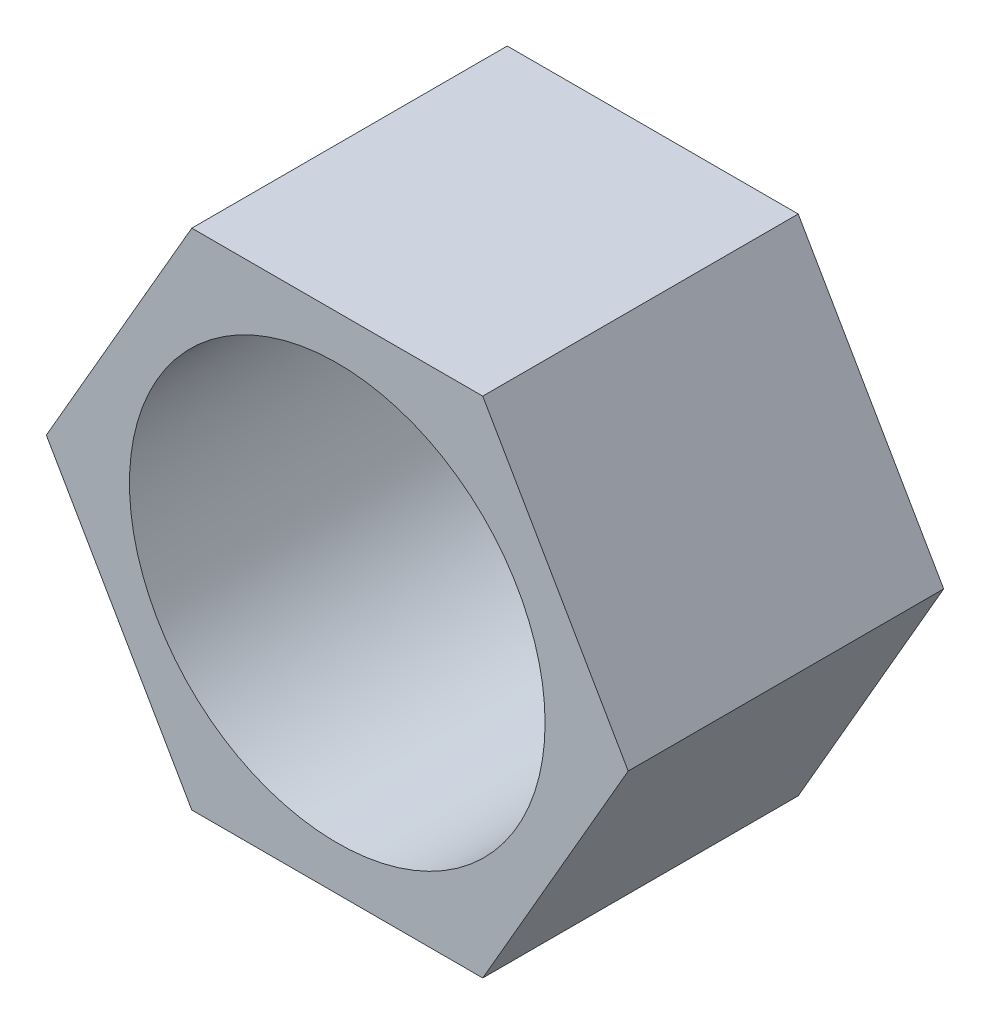
ISO-10303-21;
HEADER;
FILE_DESCRIPTION(('STEP AP214'),'2;1');
FILE_NAME('part.step','',(''),(''),'','','');
FILE_SCHEMA(('AUTOMOTIVE_DESIGN { 1 0 10303 214 1 1 1 1 }'));
ENDSEC;
DATA;
#1=APPLICATION_CONTEXT('core data for automotive mechanical design processes');
#2=APPLICATION_PROTOCOL_DEFINITION('international standard','automotive_design',2000,#1);
#3=PRODUCT_CONTEXT('',#1,'mechanical');
#4=PRODUCT('Part','Part','',(#3));
#5=PRODUCT_RELATED_PRODUCT_CATEGORY('part','',(#4));
#6=PRODUCT_DEFINITION_FORMATION('','',#4);
#7=PRODUCT_DEFINITION_CONTEXT('part definition',#1,'design');
#8=PRODUCT_DEFINITION('design','',#6,#7);
#9=PRODUCT_DEFINITION_SHAPE('','',#8);
#10=(LENGTH_UNIT() NAMED_UNIT(*) SI_UNIT(.MILLI.,.METRE.));
#11=(NAMED_UNIT(*) PLANE_ANGLE_UNIT() SI_UNIT($,.RADIAN.));
#12=(NAMED_UNIT(*) SI_UNIT($,.STERADIAN.) SOLID_ANGLE_UNIT());
#13=UNCERTAINTY_MEASURE_WITH_UNIT(LENGTH_MEASURE(1.E-05),#10,'distance_accuracy_value','');
#14=(GEOMETRIC_REPRESENTATION_CONTEXT(3) GLOBAL_UNCERTAINTY_ASSIGNED_CONTEXT((#13)) GLOBAL_UNIT_ASSIGNED_CONTEXT((#10,
#11,#12)) REPRESENTATION_CONTEXT('',''));
#15=CARTESIAN_POINT('',(0.,0.,0.));
#16=DIRECTION('',(0.,0.,1.));
#17=DIRECTION('',(1.,0.,0.));
#18=AXIS2_PLACEMENT_3D('',#15,#16,#17);
#19=CARTESIAN_POINT('',(0.,0.,7.59));
#20=DIRECTION('',(0.,0.,1.));
#21=DIRECTION('',(1.,0.,0.));
#22=AXIS2_PLACEMENT_3D('',#19,#20,#21);
#23=PLANE('',#22);
#24=DIRECTION('',(0.499999999999995,0.866025403784442,0.));
#25=VECTOR('',#24,1.);
#26=CARTESIAN_POINT('',(3.50000000000007,-6.06217782649103,7.59));
#27=LINE('',#26,#25);
#28=CARTESIAN_POINT('',(3.50000000000007,-6.06217782649103,7.59));
#29=VERTEX_POINT('',#28);
#30=CARTESIAN_POINT('',(7.,0.,7.59));
#31=VERTEX_POINT('',#30);
#32=EDGE_CURVE('E146',#29,#31,#27,.T.);
#33=ORIENTED_EDGE('',*,*,#32,.T.);
#34=DIRECTION('',(-0.500000000000001,0.866025403784438,0.));
#35=VECTOR('',#34,1.);
#36=CARTESIAN_POINT('',(7.,0.,7.59));
#37=LINE('',#36,#35);
#38=CARTESIAN_POINT('',(3.49999999999999,6.06217782649108,7.59));
#39=VERTEX_POINT('',#38);
#40=EDGE_CURVE('E94',#31,#39,#37,.T.);
#41=ORIENTED_EDGE('',*,*,#40,.T.);
#42=DIRECTION('',(-1.,0.,0.));
#43=VECTOR('',#42,1.);
#44=CARTESIAN_POINT('',(3.49999999999999,6.06217782649108,7.59));
#45=LINE('',#44,#43);
#46=CARTESIAN_POINT('',(-3.50000000000003,6.06217782649105,7.59));
#47=VERTEX_POINT('',#46);
#48=EDGE_CURVE('E107',#39,#47,#45,.T.);
#49=ORIENTED_EDGE('',*,*,#48,.T.);
#50=DIRECTION('',(-0.499999999999995,-0.866025403784441,0.));
#51=VECTOR('',#50,1.);
#52=CARTESIAN_POINT('',(-3.50000000000003,6.06217782649105,7.59));
#53=LINE('',#52,#51);
#54=CARTESIAN_POINT('',(-7.,0.,7.59));
#55=VERTEX_POINT('',#54);
#56=EDGE_CURVE('E101',#47,#55,#53,.T.);
#57=ORIENTED_EDGE('',*,*,#56,.T.);
#58=DIRECTION('',(0.500000000000007,-0.866025403784435,0.));
#59=VECTOR('',#58,1.);
#60=CARTESIAN_POINT('',(-7.,0.,7.59));
#61=LINE('',#60,#59);
#62=CARTESIAN_POINT('',(-3.49999999999994,-6.0621778264911,7.59));
#63=VERTEX_POINT('',#62);
#64=EDGE_CURVE('E105',#55,#63,#61,.T.);
#65=ORIENTED_EDGE('',*,*,#64,.T.);
#66=DIRECTION('',(1.,0.,0.));
#67=VECTOR('',#66,1.);
#68=CARTESIAN_POINT('',(-3.49999999999994,-6.0621778264911,7.59));
#69=LINE('',#68,#67);
#70=EDGE_CURVE('E57',#63,#29,#69,.T.);
#71=ORIENTED_EDGE('',*,*,#70,.T.);
#72=EDGE_LOOP('',(#33,#41,#49,#57,#65,#71));
#73=FACE_BOUND('',#72,.T.);
#74=CARTESIAN_POINT('',(0.,0.,7.59));
#75=DIRECTION('',(0.,0.,1.));
#76=DIRECTION('',(1.,0.,0.));
#77=AXIS2_PLACEMENT_3D('',#74,#75,#76);
#78=CIRCLE('',#77,5.);
#79=CARTESIAN_POINT('',(5.,0.,7.59));
#80=VERTEX_POINT('',#79);
#81=EDGE_CURVE('E134',#80,#80,#78,.T.);
#82=ORIENTED_EDGE('',*,*,#81,.F.);
#83=EDGE_LOOP('',(#82));
#84=FACE_BOUND('',#83,.T.);
#85=ADVANCED_FACE('F39',(#73,#84),#23,.T.);
#86=CARTESIAN_POINT('',(0.,0.,0.));
#87=DIRECTION('',(0.,0.,1.));
#88=DIRECTION('',(1.,0.,0.));
#89=AXIS2_PLACEMENT_3D('',#86,#87,#88);
#90=PLANE('',#89);
#91=DIRECTION('',(0.499999999999995,0.866025403784442,0.));
#92=VECTOR('',#91,1.);
#93=CARTESIAN_POINT('',(3.50000000000007,-6.06217782649103,0.));
#94=LINE('',#93,#92);
#95=CARTESIAN_POINT('',(3.50000000000007,-6.06217782649103,0.));
#96=VERTEX_POINT('',#95);
#97=CARTESIAN_POINT('',(7.,0.,0.));
#98=VERTEX_POINT('',#97);
#99=EDGE_CURVE('E129',#96,#98,#94,.T.);
#100=ORIENTED_EDGE('',*,*,#99,.F.);
#101=DIRECTION('',(1.,0.,0.));
#102=VECTOR('',#101,1.);
#103=CARTESIAN_POINT('',(-3.49999999999994,-6.0621778264911,0.));
#104=LINE('',#103,#102);
#105=CARTESIAN_POINT('',(-3.49999999999994,-6.0621778264911,0.));
#106=VERTEX_POINT('',#105);
#107=EDGE_CURVE('E86',#106,#96,#104,.T.);
#108=ORIENTED_EDGE('',*,*,#107,.F.);
#109=DIRECTION('',(0.500000000000007,-0.866025403784435,0.));
#110=VECTOR('',#109,1.);
#111=CARTESIAN_POINT('',(-7.,0.,0.));
#112=LINE('',#111,#110);
#113=CARTESIAN_POINT('',(-7.,0.,0.));
#114=VERTEX_POINT('',#113);
#115=EDGE_CURVE('E80',#114,#106,#112,.T.);
#116=ORIENTED_EDGE('',*,*,#115,.F.);
#117=DIRECTION('',(-0.499999999999995,-0.866025403784441,0.));
#118=VECTOR('',#117,1.);
#119=CARTESIAN_POINT('',(-3.50000000000003,6.06217782649105,0.));
#120=LINE('',#119,#118);
#121=CARTESIAN_POINT('',(-3.50000000000003,6.06217782649105,0.));
#122=VERTEX_POINT('',#121);
#123=EDGE_CURVE('E116',#122,#114,#120,.T.);
#124=ORIENTED_EDGE('',*,*,#123,.F.);
#125=DIRECTION('',(-1.,0.,0.));
#126=VECTOR('',#125,1.);
#127=CARTESIAN_POINT('',(3.49999999999999,6.06217782649108,0.));
#128=LINE('',#127,#126);
#129=CARTESIAN_POINT('',(3.49999999999999,6.06217782649108,0.));
#130=VERTEX_POINT('',#129);
#131=EDGE_CURVE('E137',#130,#122,#128,.T.);
#132=ORIENTED_EDGE('',*,*,#131,.F.);
#133=DIRECTION('',(-0.500000000000001,0.866025403784438,0.));
#134=VECTOR('',#133,1.);
#135=CARTESIAN_POINT('',(7.,0.,0.));
#136=LINE('',#135,#134);
#137=EDGE_CURVE('E133',#98,#130,#136,.T.);
#138=ORIENTED_EDGE('',*,*,#137,.F.);
#139=EDGE_LOOP('',(#100,#108,#116,#124,#132,#138));
#140=FACE_BOUND('',#139,.T.);
#141=CARTESIAN_POINT('',(0.,0.,0.));
#142=DIRECTION('',(0.,0.,1.));
#143=DIRECTION('',(1.,0.,0.));
#144=AXIS2_PLACEMENT_3D('',#141,#142,#143);
#145=CIRCLE('',#144,5.);
#146=CARTESIAN_POINT('',(5.,0.,0.));
#147=VERTEX_POINT('',#146);
#148=EDGE_CURVE('E243',#147,#147,#145,.T.);
#149=ORIENTED_EDGE('',*,*,#148,.T.);
#150=EDGE_LOOP('',(#149));
#151=FACE_BOUND('',#150,.T.);
#152=ADVANCED_FACE('F159',(#140,#151),#90,.F.);
#153=CARTESIAN_POINT('',(3.50000000000007,-6.06217782649103,7.59));
#154=DIRECTION('',(-0.866025403784441,0.499999999999995,0.));
#155=DIRECTION('',(-0.499999999999995,-0.866025403784442,0.));
#156=AXIS2_PLACEMENT_3D('',#153,#154,#155);
#157=PLANE('',#156);
#158=ORIENTED_EDGE('',*,*,#99,.T.);
#159=DIRECTION('',(0.,0.,-1.));
#160=VECTOR('',#159,1.);
#161=CARTESIAN_POINT('',(7.,0.,7.59));
#162=LINE('',#161,#160);
#163=EDGE_CURVE('E11',#31,#98,#162,.T.);
#164=ORIENTED_EDGE('',*,*,#163,.F.);
#165=ORIENTED_EDGE('',*,*,#32,.F.);
#166=DIRECTION('',(0.,0.,-1.));
#167=VECTOR('',#166,1.);
#168=CARTESIAN_POINT('',(3.50000000000007,-6.06217782649103,7.59));
#169=LINE('',#168,#167);
#170=EDGE_CURVE('E125',#29,#96,#169,.T.);
#171=ORIENTED_EDGE('',*,*,#170,.T.);
#172=EDGE_LOOP('',(#158,#164,#165,#171));
#173=FACE_BOUND('',#172,.T.);
#174=ADVANCED_FACE('F41',(#173),#157,.F.);
#175=CARTESIAN_POINT('',(7.,0.,7.59));
#176=DIRECTION('',(-0.866025403784438,-0.500000000000001,0.));
#177=DIRECTION('',(0.500000000000001,-0.866025403784438,0.));
#178=AXIS2_PLACEMENT_3D('',#175,#176,#177);
#179=PLANE('',#178);
#180=ORIENTED_EDGE('',*,*,#137,.T.);
#181=DIRECTION('',(0.,0.,-1.));
#182=VECTOR('',#181,1.);
#183=CARTESIAN_POINT('',(3.49999999999999,6.06217782649108,7.59));
#184=LINE('',#183,#182);
#185=EDGE_CURVE('E49',#39,#130,#184,.T.);
#186=ORIENTED_EDGE('',*,*,#185,.F.);
#187=ORIENTED_EDGE('',*,*,#40,.F.);
#188=ORIENTED_EDGE('',*,*,#163,.T.);
#189=EDGE_LOOP('',(#180,#186,#187,#188));
#190=FACE_BOUND('',#189,.T.);
#191=ADVANCED_FACE('F184',(#190),#179,.F.);
#192=CARTESIAN_POINT('',(3.49999999999999,6.06217782649108,7.59));
#193=DIRECTION('',(0.,-1.,0.));
#194=DIRECTION('',(1.,0.,0.));
#195=AXIS2_PLACEMENT_3D('',#192,#193,#194);
#196=PLANE('',#195);
#197=ORIENTED_EDGE('',*,*,#131,.T.);
#198=DIRECTION('',(0.,0.,-1.));
#199=VECTOR('',#198,1.);
#200=CARTESIAN_POINT('',(-3.50000000000003,6.06217782649105,7.59));
#201=LINE('',#200,#199);
#202=EDGE_CURVE('E118',#47,#122,#201,.T.);
#203=ORIENTED_EDGE('',*,*,#202,.F.);
#204=ORIENTED_EDGE('',*,*,#48,.F.);
#205=ORIENTED_EDGE('',*,*,#185,.T.);
#206=EDGE_LOOP('',(#197,#203,#204,#205));
#207=FACE_BOUND('',#206,.T.);
#208=ADVANCED_FACE('F156',(#207),#196,.F.);
#209=CARTESIAN_POINT('',(-3.50000000000003,6.06217782649105,7.59));
#210=DIRECTION('',(0.866025403784441,-0.499999999999995,0.));
#211=DIRECTION('',(0.499999999999995,0.866025403784441,0.));
#212=AXIS2_PLACEMENT_3D('',#209,#210,#211);
#213=PLANE('',#212);
#214=ORIENTED_EDGE('',*,*,#123,.T.);
#215=DIRECTION('',(0.,0.,-1.));
#216=VECTOR('',#215,1.);
#217=CARTESIAN_POINT('',(-7.,0.,7.59));
#218=LINE('',#217,#216);
#219=EDGE_CURVE('E113',#55,#114,#218,.T.);
#220=ORIENTED_EDGE('',*,*,#219,.F.);
#221=ORIENTED_EDGE('',*,*,#56,.F.);
#222=ORIENTED_EDGE('',*,*,#202,.T.);
#223=EDGE_LOOP('',(#214,#220,#221,#222));
#224=FACE_BOUND('',#223,.T.);
#225=ADVANCED_FACE('F114',(#224),#213,.F.);
#226=CARTESIAN_POINT('',(-7.,0.,7.59));
#227=DIRECTION('',(0.866025403784435,0.500000000000007,0.));
#228=DIRECTION('',(-0.500000000000007,0.866025403784435,0.));
#229=AXIS2_PLACEMENT_3D('',#226,#227,#228);
#230=PLANE('',#229);
#231=ORIENTED_EDGE('',*,*,#115,.T.);
#232=DIRECTION('',(0.,0.,-1.));
#233=VECTOR('',#232,1.);
#234=CARTESIAN_POINT('',(-3.49999999999994,-6.0621778264911,7.59));
#235=LINE('',#234,#233);
#236=EDGE_CURVE('E119',#63,#106,#235,.T.);
#237=ORIENTED_EDGE('',*,*,#236,.F.);
#238=ORIENTED_EDGE('',*,*,#64,.F.);
#239=ORIENTED_EDGE('',*,*,#219,.T.);
#240=EDGE_LOOP('',(#231,#237,#238,#239));
#241=FACE_BOUND('',#240,.T.);
#242=ADVANCED_FACE('F121',(#241),#230,.F.);
#243=CARTESIAN_POINT('',(-3.49999999999994,-6.0621778264911,7.59));
#244=DIRECTION('',(0.,1.,0.));
#245=DIRECTION('',(-1.,0.,0.));
#246=AXIS2_PLACEMENT_3D('',#243,#244,#245);
#247=PLANE('',#246);
#248=ORIENTED_EDGE('',*,*,#107,.T.);
#249=ORIENTED_EDGE('',*,*,#170,.F.);
#250=ORIENTED_EDGE('',*,*,#70,.F.);
#251=ORIENTED_EDGE('',*,*,#236,.T.);
#252=EDGE_LOOP('',(#248,#249,#250,#251));
#253=FACE_BOUND('',#252,.T.);
#254=ADVANCED_FACE('F164',(#253),#247,.F.);
#255=CARTESIAN_POINT('',(0.,0.,7.59));
#256=DIRECTION('',(0.,0.,-1.));
#257=DIRECTION('',(-1.,0.,0.));
#258=AXIS2_PLACEMENT_3D('',#255,#256,#257);
#259=CYLINDRICAL_SURFACE('',#258,5.);
#260=ORIENTED_EDGE('',*,*,#81,.T.);
#261=EDGE_LOOP('',(#260));
#262=FACE_BOUND('',#261,.T.);
#263=ORIENTED_EDGE('',*,*,#148,.F.);
#264=EDGE_LOOP('',(#263));
#265=FACE_BOUND('',#264,.T.);
#266=ADVANCED_FACE('F166',(#262,#265),#259,.F.);
#267=CLOSED_SHELL('',(#85,#152,#174,#191,#208,#225,#242,#254,#266));
#268=MANIFOLD_SOLID_BREP('B2',#267);
#269=ADVANCED_BREP_SHAPE_REPRESENTATION('',(#18,#268),#14);
#270=SHAPE_DEFINITION_REPRESENTATION(#9,#269);
ENDSEC;
END-ISO-10303-21;
